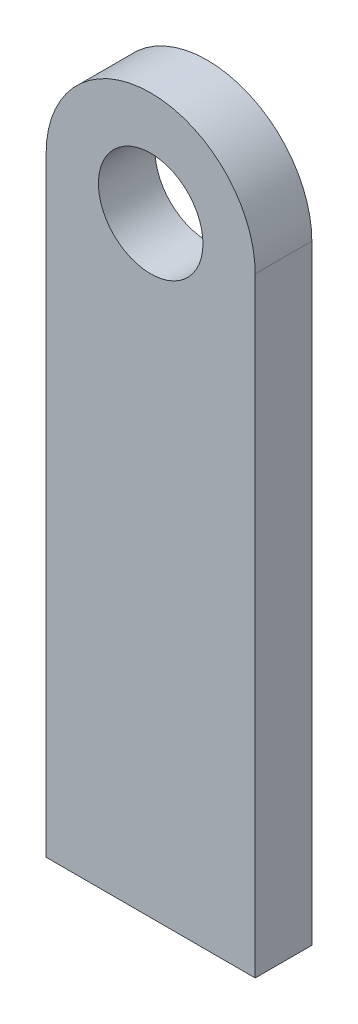
ISO-10303-21;
HEADER;
FILE_DESCRIPTION(('STEP AP214'),'2;1');
FILE_NAME('part.step','',(''),(''),'','','');
FILE_SCHEMA(('AUTOMOTIVE_DESIGN { 1 0 10303 214 1 1 1 1 }'));
ENDSEC;
DATA;
#1=APPLICATION_CONTEXT('core data for automotive mechanical design processes');
#2=APPLICATION_PROTOCOL_DEFINITION('international standard','automotive_design',2000,#1);
#3=PRODUCT_CONTEXT('',#1,'mechanical');
#4=PRODUCT('Part','Part','',(#3));
#5=PRODUCT_RELATED_PRODUCT_CATEGORY('part','',(#4));
#6=PRODUCT_DEFINITION_FORMATION('','',#4);
#7=PRODUCT_DEFINITION_CONTEXT('part definition',#1,'design');
#8=PRODUCT_DEFINITION('design','',#6,#7);
#9=PRODUCT_DEFINITION_SHAPE('','',#8);
#10=(LENGTH_UNIT() NAMED_UNIT(*) SI_UNIT(.MILLI.,.METRE.));
#11=(NAMED_UNIT(*) PLANE_ANGLE_UNIT() SI_UNIT($,.RADIAN.));
#12=(NAMED_UNIT(*) SI_UNIT($,.STERADIAN.) SOLID_ANGLE_UNIT());
#13=UNCERTAINTY_MEASURE_WITH_UNIT(LENGTH_MEASURE(1.E-05),#10,'distance_accuracy_value','');
#14=(GEOMETRIC_REPRESENTATION_CONTEXT(3) GLOBAL_UNCERTAINTY_ASSIGNED_CONTEXT((#13)) GLOBAL_UNIT_ASSIGNED_CONTEXT((#10,
#11,#12)) REPRESENTATION_CONTEXT('',''));
#15=CARTESIAN_POINT('',(0.,0.,0.));
#16=DIRECTION('',(0.,0.,1.));
#17=DIRECTION('',(1.,0.,0.));
#18=AXIS2_PLACEMENT_3D('',#15,#16,#17);
#19=CARTESIAN_POINT('',(12.,0.,6.5));
#20=DIRECTION('',(1.,0.,0.));
#21=DIRECTION('',(0.,1.,0.));
#22=AXIS2_PLACEMENT_3D('',#19,#20,#21);
#23=PLANE('',#22);
#24=DIRECTION('',(0.,-1.,0.));
#25=VECTOR('',#24,1.);
#26=CARTESIAN_POINT('',(12.,0.,0.));
#27=LINE('',#26,#25);
#28=CARTESIAN_POINT('',(12.,0.,0.));
#29=VERTEX_POINT('',#28);
#30=CARTESIAN_POINT('',(12.,-70.,0.));
#31=VERTEX_POINT('',#30);
#32=EDGE_CURVE('E121',#29,#31,#27,.T.);
#33=ORIENTED_EDGE('',*,*,#32,.F.);
#34=DIRECTION('',(0.,0.,-1.));
#35=VECTOR('',#34,1.);
#36=CARTESIAN_POINT('',(12.,0.,6.5));
#37=LINE('',#36,#35);
#38=CARTESIAN_POINT('',(12.,0.,6.5));
#39=VERTEX_POINT('',#38);
#40=EDGE_CURVE('E11',#39,#29,#37,.T.);
#41=ORIENTED_EDGE('',*,*,#40,.F.);
#42=DIRECTION('',(0.,-1.,0.));
#43=VECTOR('',#42,1.);
#44=CARTESIAN_POINT('',(12.,0.,6.5));
#45=LINE('',#44,#43);
#46=CARTESIAN_POINT('',(12.,-70.,6.5));
#47=VERTEX_POINT('',#46);
#48=EDGE_CURVE('E100',#39,#47,#45,.T.);
#49=ORIENTED_EDGE('',*,*,#48,.T.);
#50=DIRECTION('',(0.,0.,-1.));
#51=VECTOR('',#50,1.);
#52=CARTESIAN_POINT('',(12.,-70.,6.5));
#53=LINE('',#52,#51);
#54=EDGE_CURVE('E81',#47,#31,#53,.T.);
#55=ORIENTED_EDGE('',*,*,#54,.T.);
#56=EDGE_LOOP('',(#33,#41,#49,#55));
#57=FACE_BOUND('',#56,.T.);
#58=ADVANCED_FACE('F41',(#57),#23,.T.);
#59=CARTESIAN_POINT('',(0.,0.,6.5));
#60=DIRECTION('',(0.,0.,-1.));
#61=DIRECTION('',(-1.,0.,0.));
#62=AXIS2_PLACEMENT_3D('',#59,#60,#61);
#63=CYLINDRICAL_SURFACE('',#62,12.);
#64=CARTESIAN_POINT('',(0.,0.,0.));
#65=DIRECTION('',(0.,0.,1.));
#66=DIRECTION('',(1.,0.,0.));
#67=AXIS2_PLACEMENT_3D('',#64,#65,#66);
#68=CIRCLE('',#67,12.);
#69=CARTESIAN_POINT('',(-12.,0.,0.));
#70=VERTEX_POINT('',#69);
#71=EDGE_CURVE('E106',#29,#70,#68,.T.);
#72=ORIENTED_EDGE('',*,*,#71,.T.);
#73=DIRECTION('',(0.,0.,-1.));
#74=VECTOR('',#73,1.);
#75=CARTESIAN_POINT('',(-12.,0.,6.5));
#76=LINE('',#75,#74);
#77=CARTESIAN_POINT('',(-12.,0.,6.5));
#78=VERTEX_POINT('',#77);
#79=EDGE_CURVE('E51',#78,#70,#76,.T.);
#80=ORIENTED_EDGE('',*,*,#79,.F.);
#81=CARTESIAN_POINT('',(0.,0.,6.5));
#82=DIRECTION('',(0.,0.,1.));
#83=DIRECTION('',(1.,0.,0.));
#84=AXIS2_PLACEMENT_3D('',#81,#82,#83);
#85=CIRCLE('',#84,12.);
#86=EDGE_CURVE('E97',#39,#78,#85,.T.);
#87=ORIENTED_EDGE('',*,*,#86,.F.);
#88=ORIENTED_EDGE('',*,*,#40,.T.);
#89=EDGE_LOOP('',(#72,#80,#87,#88));
#90=FACE_BOUND('',#89,.T.);
#91=ADVANCED_FACE('F104',(#90),#63,.T.);
#92=CARTESIAN_POINT('',(-12.,0.,6.5));
#93=DIRECTION('',(1.,0.,0.));
#94=DIRECTION('',(0.,1.,0.));
#95=AXIS2_PLACEMENT_3D('',#92,#93,#94);
#96=PLANE('',#95);
#97=DIRECTION('',(0.,-1.,0.));
#98=VECTOR('',#97,1.);
#99=CARTESIAN_POINT('',(-12.,0.,0.));
#100=LINE('',#99,#98);
#101=CARTESIAN_POINT('',(-12.,-70.,0.));
#102=VERTEX_POINT('',#101);
#103=EDGE_CURVE('E116',#70,#102,#100,.T.);
#104=ORIENTED_EDGE('',*,*,#103,.T.);
#105=DIRECTION('',(0.,0.,-1.));
#106=VECTOR('',#105,1.);
#107=CARTESIAN_POINT('',(-12.,-70.,6.5));
#108=LINE('',#107,#106);
#109=CARTESIAN_POINT('',(-12.,-70.,6.5));
#110=VERTEX_POINT('',#109);
#111=EDGE_CURVE('E95',#110,#102,#108,.T.);
#112=ORIENTED_EDGE('',*,*,#111,.F.);
#113=DIRECTION('',(0.,-1.,0.));
#114=VECTOR('',#113,1.);
#115=CARTESIAN_POINT('',(-12.,0.,6.5));
#116=LINE('',#115,#114);
#117=EDGE_CURVE('E89',#78,#110,#116,.T.);
#118=ORIENTED_EDGE('',*,*,#117,.F.);
#119=ORIENTED_EDGE('',*,*,#79,.T.);
#120=EDGE_LOOP('',(#104,#112,#118,#119));
#121=FACE_BOUND('',#120,.T.);
#122=ADVANCED_FACE('F92',(#121),#96,.F.);
#123=CARTESIAN_POINT('',(0.,0.,6.5));
#124=DIRECTION('',(0.,0.,-1.));
#125=DIRECTION('',(-1.,0.,0.));
#126=AXIS2_PLACEMENT_3D('',#123,#124,#125);
#127=CYLINDRICAL_SURFACE('',#126,6.);
#128=CARTESIAN_POINT('',(0.,0.,6.5));
#129=DIRECTION('',(0.,0.,1.));
#130=DIRECTION('',(1.,0.,0.));
#131=AXIS2_PLACEMENT_3D('',#128,#129,#130);
#132=CIRCLE('',#131,6.);
#133=CARTESIAN_POINT('',(6.,0.,6.5));
#134=VERTEX_POINT('',#133);
#135=EDGE_CURVE('E115',#134,#134,#132,.T.);
#136=ORIENTED_EDGE('',*,*,#135,.T.);
#137=EDGE_LOOP('',(#136));
#138=FACE_BOUND('',#137,.T.);
#139=CARTESIAN_POINT('',(0.,0.,0.));
#140=DIRECTION('',(0.,0.,1.));
#141=DIRECTION('',(1.,0.,0.));
#142=AXIS2_PLACEMENT_3D('',#139,#140,#141);
#143=CIRCLE('',#142,6.);
#144=CARTESIAN_POINT('',(6.,0.,0.));
#145=VERTEX_POINT('',#144);
#146=EDGE_CURVE('E124',#145,#145,#143,.T.);
#147=ORIENTED_EDGE('',*,*,#146,.F.);
#148=EDGE_LOOP('',(#147));
#149=FACE_BOUND('',#148,.T.);
#150=ADVANCED_FACE('F43',(#138,#149),#127,.F.);
#151=CARTESIAN_POINT('',(0.,-70.,6.5));
#152=DIRECTION('',(0.,1.,0.));
#153=DIRECTION('',(0.,0.,1.));
#154=AXIS2_PLACEMENT_3D('',#151,#152,#153);
#155=PLANE('',#154);
#156=DIRECTION('',(1.,0.,0.));
#157=VECTOR('',#156,1.);
#158=CARTESIAN_POINT('',(0.,-70.,0.));
#159=LINE('',#158,#157);
#160=EDGE_CURVE('E74',#102,#31,#159,.T.);
#161=ORIENTED_EDGE('',*,*,#160,.T.);
#162=ORIENTED_EDGE('',*,*,#54,.F.);
#163=DIRECTION('',(1.,0.,0.));
#164=VECTOR('',#163,1.);
#165=CARTESIAN_POINT('',(0.,-70.,6.5));
#166=LINE('',#165,#164);
#167=EDGE_CURVE('E59',#110,#47,#166,.T.);
#168=ORIENTED_EDGE('',*,*,#167,.F.);
#169=ORIENTED_EDGE('',*,*,#111,.T.);
#170=EDGE_LOOP('',(#161,#162,#168,#169));
#171=FACE_BOUND('',#170,.T.);
#172=ADVANCED_FACE('F140',(#171),#155,.F.);
#173=CARTESIAN_POINT('',(0.,0.,6.5));
#174=DIRECTION('',(0.,0.,1.));
#175=DIRECTION('',(1.,0.,0.));
#176=AXIS2_PLACEMENT_3D('',#173,#174,#175);
#177=PLANE('',#176);
#178=ORIENTED_EDGE('',*,*,#135,.F.);
#179=EDGE_LOOP('',(#178));
#180=FACE_BOUND('',#179,.T.);
#181=ORIENTED_EDGE('',*,*,#48,.F.);
#182=ORIENTED_EDGE('',*,*,#86,.T.);
#183=ORIENTED_EDGE('',*,*,#117,.T.);
#184=ORIENTED_EDGE('',*,*,#167,.T.);
#185=EDGE_LOOP('',(#181,#182,#183,#184));
#186=FACE_BOUND('',#185,.T.);
#187=ADVANCED_FACE('F99',(#180,#186),#177,.T.);
#188=CARTESIAN_POINT('',(0.,0.,0.));
#189=DIRECTION('',(0.,0.,1.));
#190=DIRECTION('',(1.,0.,0.));
#191=AXIS2_PLACEMENT_3D('',#188,#189,#190);
#192=PLANE('',#191);
#193=ORIENTED_EDGE('',*,*,#146,.T.);
#194=EDGE_LOOP('',(#193));
#195=FACE_BOUND('',#194,.T.);
#196=ORIENTED_EDGE('',*,*,#32,.T.);
#197=ORIENTED_EDGE('',*,*,#160,.F.);
#198=ORIENTED_EDGE('',*,*,#103,.F.);
#199=ORIENTED_EDGE('',*,*,#71,.F.);
#200=EDGE_LOOP('',(#196,#197,#198,#199));
#201=FACE_BOUND('',#200,.T.);
#202=ADVANCED_FACE('F139',(#195,#201),#192,.F.);
#203=CLOSED_SHELL('',(#58,#91,#122,#150,#172,#187,#202));
#204=MANIFOLD_SOLID_BREP('B2',#203);
#205=ADVANCED_BREP_SHAPE_REPRESENTATION('',(#18,#204),#14);
#206=SHAPE_DEFINITION_REPRESENTATION(#9,#205);
ENDSEC;
END-ISO-10303-21;
